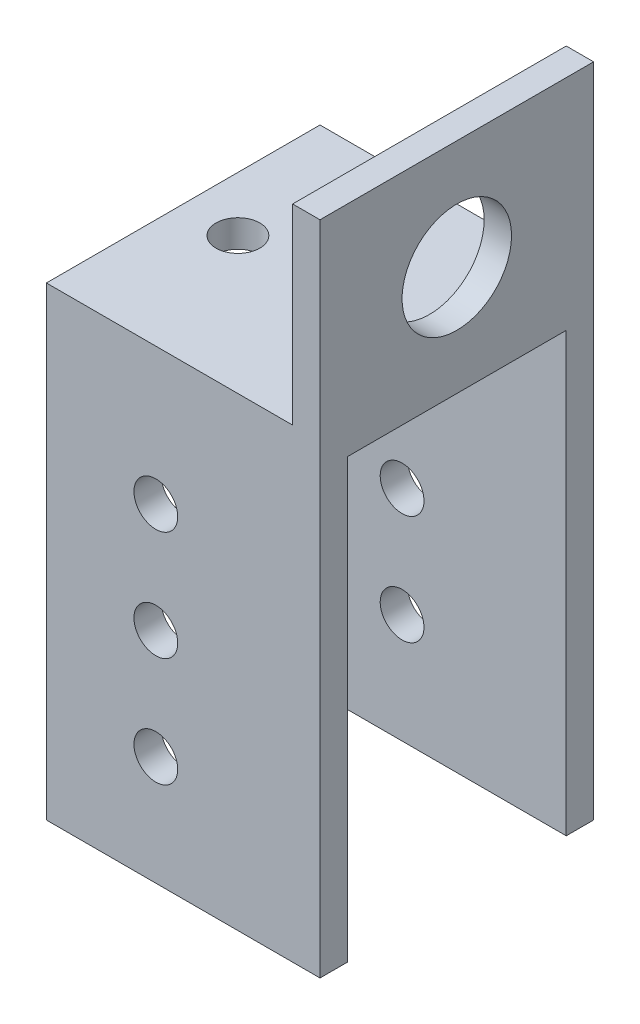
ISO-10303-21;
HEADER;
FILE_DESCRIPTION(('STEP AP214'),'2;1');
FILE_NAME('part.step','',(''),(''),'','','');
FILE_SCHEMA(('AUTOMOTIVE_DESIGN { 1 0 10303 214 1 1 1 1 }'));
ENDSEC;
DATA;
#1=APPLICATION_CONTEXT('core data for automotive mechanical design processes');
#2=APPLICATION_PROTOCOL_DEFINITION('international standard','automotive_design',2000,#1);
#3=PRODUCT_CONTEXT('',#1,'mechanical');
#4=PRODUCT('Part','Part','',(#3));
#5=PRODUCT_RELATED_PRODUCT_CATEGORY('part','',(#4));
#6=PRODUCT_DEFINITION_FORMATION('','',#4);
#7=PRODUCT_DEFINITION_CONTEXT('part definition',#1,'design');
#8=PRODUCT_DEFINITION('design','',#6,#7);
#9=PRODUCT_DEFINITION_SHAPE('','',#8);
#10=(LENGTH_UNIT() NAMED_UNIT(*) SI_UNIT(.MILLI.,.METRE.));
#11=(NAMED_UNIT(*) PLANE_ANGLE_UNIT() SI_UNIT($,.RADIAN.));
#12=(NAMED_UNIT(*) SI_UNIT($,.STERADIAN.) SOLID_ANGLE_UNIT());
#13=UNCERTAINTY_MEASURE_WITH_UNIT(LENGTH_MEASURE(1.E-05),#10,'distance_accuracy_value','');
#14=(GEOMETRIC_REPRESENTATION_CONTEXT(3) GLOBAL_UNCERTAINTY_ASSIGNED_CONTEXT((#13)) GLOBAL_UNIT_ASSIGNED_CONTEXT((#10,
#11,#12)) REPRESENTATION_CONTEXT('',''));
#15=CARTESIAN_POINT('',(0.,0.,0.));
#16=DIRECTION('',(0.,0.,1.));
#17=DIRECTION('',(1.,0.,0.));
#18=AXIS2_PLACEMENT_3D('',#15,#16,#17);
#19=CARTESIAN_POINT('',(0.,-38.1,31.75));
#20=DIRECTION('',(0.,1.,0.));
#21=DIRECTION('',(0.,0.,1.));
#22=AXIS2_PLACEMENT_3D('',#19,#20,#21);
#23=PLANE('',#22);
#24=DIRECTION('',(0.,0.,-1.));
#25=VECTOR('',#24,1.);
#26=CARTESIAN_POINT('',(15.875,-38.1,31.75));
#27=LINE('',#26,#25);
#28=CARTESIAN_POINT('',(15.875,-38.1,3.17500000000001));
#29=VERTEX_POINT('',#28);
#30=CARTESIAN_POINT('',(15.875,-38.1,0.));
#31=VERTEX_POINT('',#30);
#32=EDGE_CURVE('E180',#29,#31,#27,.T.);
#33=ORIENTED_EDGE('',*,*,#32,.F.);
#34=DIRECTION('',(-1.,0.,0.));
#35=VECTOR('',#34,1.);
#36=CARTESIAN_POINT('',(15.875,-38.1,3.17500000000001));
#37=LINE('',#36,#35);
#38=CARTESIAN_POINT('',(-15.875,-38.1,3.17500000000001));
#39=VERTEX_POINT('',#38);
#40=EDGE_CURVE('E242',#29,#39,#37,.T.);
#41=ORIENTED_EDGE('',*,*,#40,.T.);
#42=DIRECTION('',(0.,0.,-1.));
#43=VECTOR('',#42,1.);
#44=CARTESIAN_POINT('',(-15.875,-38.1,31.75));
#45=LINE('',#44,#43);
#46=CARTESIAN_POINT('',(-15.875,-38.1,0.));
#47=VERTEX_POINT('',#46);
#48=EDGE_CURVE('E131',#39,#47,#45,.T.);
#49=ORIENTED_EDGE('',*,*,#48,.T.);
#50=DIRECTION('',(1.,0.,0.));
#51=VECTOR('',#50,1.);
#52=CARTESIAN_POINT('',(0.,-38.1,0.));
#53=LINE('',#52,#51);
#54=EDGE_CURVE('E170',#47,#31,#53,.T.);
#55=ORIENTED_EDGE('',*,*,#54,.T.);
#56=EDGE_LOOP('',(#33,#41,#49,#55));
#57=FACE_BOUND('',#56,.T.);
#58=ADVANCED_FACE('F45',(#57),#23,.F.);
#59=CARTESIAN_POINT('',(0.,38.1,31.75));
#60=DIRECTION('',(0.,1.,0.));
#61=DIRECTION('',(0.,0.,1.));
#62=AXIS2_PLACEMENT_3D('',#59,#60,#61);
#63=PLANE('',#62);
#64=DIRECTION('',(1.,0.,0.));
#65=VECTOR('',#64,1.);
#66=CARTESIAN_POINT('',(0.,38.1,0.));
#67=LINE('',#66,#65);
#68=CARTESIAN_POINT('',(12.7,38.1,0.));
#69=VERTEX_POINT('',#68);
#70=CARTESIAN_POINT('',(15.875,38.1,0.));
#71=VERTEX_POINT('',#70);
#72=EDGE_CURVE('E153',#69,#71,#67,.T.);
#73=ORIENTED_EDGE('',*,*,#72,.F.);
#74=DIRECTION('',(0.,0.,-1.));
#75=VECTOR('',#74,1.);
#76=CARTESIAN_POINT('',(12.7,38.1,31.75));
#77=LINE('',#76,#75);
#78=CARTESIAN_POINT('',(12.7,38.1,31.75));
#79=VERTEX_POINT('',#78);
#80=EDGE_CURVE('E11',#79,#69,#77,.T.);
#81=ORIENTED_EDGE('',*,*,#80,.F.);
#82=DIRECTION('',(1.,0.,0.));
#83=VECTOR('',#82,1.);
#84=CARTESIAN_POINT('',(0.,38.1,31.75));
#85=LINE('',#84,#83);
#86=CARTESIAN_POINT('',(15.875,38.1,31.75));
#87=VERTEX_POINT('',#86);
#88=EDGE_CURVE('E177',#79,#87,#85,.T.);
#89=ORIENTED_EDGE('',*,*,#88,.T.);
#90=DIRECTION('',(0.,0.,-1.));
#91=VECTOR('',#90,1.);
#92=CARTESIAN_POINT('',(15.875,38.1,31.75));
#93=LINE('',#92,#91);
#94=EDGE_CURVE('E98',#87,#71,#93,.T.);
#95=ORIENTED_EDGE('',*,*,#94,.T.);
#96=EDGE_LOOP('',(#73,#81,#89,#95));
#97=FACE_BOUND('',#96,.T.);
#98=ADVANCED_FACE('F47',(#97),#63,.T.);
#99=CARTESIAN_POINT('',(12.7,0.,31.75));
#100=DIRECTION('',(1.,0.,0.));
#101=DIRECTION('',(0.,1.,0.));
#102=AXIS2_PLACEMENT_3D('',#99,#100,#101);
#103=PLANE('',#102);
#104=CARTESIAN_POINT('',(12.7,25.4,15.875));
#105=DIRECTION('',(1.,0.,0.));
#106=DIRECTION('',(0.,1.,0.));
#107=AXIS2_PLACEMENT_3D('',#104,#105,#106);
#108=CIRCLE('',#107,6.35);
#109=CARTESIAN_POINT('',(12.7,31.75,15.875));
#110=VERTEX_POINT('',#109);
#111=EDGE_CURVE('E377',#110,#110,#108,.F.);
#112=ORIENTED_EDGE('',*,*,#111,.F.);
#113=EDGE_LOOP('',(#112));
#114=FACE_BOUND('',#113,.T.);
#115=DIRECTION('',(0.,-1.,0.));
#116=VECTOR('',#115,1.);
#117=CARTESIAN_POINT('',(12.7,0.,0.));
#118=LINE('',#117,#116);
#119=CARTESIAN_POINT('',(12.7,15.875,0.));
#120=VERTEX_POINT('',#119);
#121=EDGE_CURVE('E157',#69,#120,#118,.T.);
#122=ORIENTED_EDGE('',*,*,#121,.T.);
#123=DIRECTION('',(0.,0.,-1.));
#124=VECTOR('',#123,1.);
#125=CARTESIAN_POINT('',(12.7,15.875,31.75));
#126=LINE('',#125,#124);
#127=CARTESIAN_POINT('',(12.7,15.875,31.75));
#128=VERTEX_POINT('',#127);
#129=EDGE_CURVE('E55',#128,#120,#126,.T.);
#130=ORIENTED_EDGE('',*,*,#129,.F.);
#131=DIRECTION('',(0.,-1.,0.));
#132=VECTOR('',#131,1.);
#133=CARTESIAN_POINT('',(12.7,0.,31.75));
#134=LINE('',#133,#132);
#135=EDGE_CURVE('E147',#79,#128,#134,.T.);
#136=ORIENTED_EDGE('',*,*,#135,.F.);
#137=ORIENTED_EDGE('',*,*,#80,.T.);
#138=EDGE_LOOP('',(#122,#130,#136,#137));
#139=FACE_BOUND('',#138,.T.);
#140=ADVANCED_FACE('F268',(#114,#139),#103,.F.);
#141=CARTESIAN_POINT('',(0.,15.875,31.75));
#142=DIRECTION('',(0.,1.,0.));
#143=DIRECTION('',(0.,0.,1.));
#144=AXIS2_PLACEMENT_3D('',#141,#142,#143);
#145=PLANE('',#144);
#146=CARTESIAN_POINT('',(-9.525,15.875,15.875));
#147=DIRECTION('',(0.,1.,0.));
#148=DIRECTION('',(0.,0.,1.));
#149=AXIS2_PLACEMENT_3D('',#146,#147,#148);
#150=CIRCLE('',#149,2.54);
#151=CARTESIAN_POINT('',(-9.525,15.875,18.415));
#152=VERTEX_POINT('',#151);
#153=EDGE_CURVE('E215',#152,#152,#150,.T.);
#154=ORIENTED_EDGE('',*,*,#153,.F.);
#155=EDGE_LOOP('',(#154));
#156=FACE_BOUND('',#155,.T.);
#157=CARTESIAN_POINT('',(3.175,15.875,15.875));
#158=DIRECTION('',(0.,1.,0.));
#159=DIRECTION('',(0.,0.,1.));
#160=AXIS2_PLACEMENT_3D('',#157,#158,#159);
#161=CIRCLE('',#160,2.54);
#162=CARTESIAN_POINT('',(3.175,15.875,18.415));
#163=VERTEX_POINT('',#162);
#164=EDGE_CURVE('E214',#163,#163,#161,.T.);
#165=ORIENTED_EDGE('',*,*,#164,.F.);
#166=EDGE_LOOP('',(#165));
#167=FACE_BOUND('',#166,.T.);
#168=DIRECTION('',(1.,0.,0.));
#169=VECTOR('',#168,1.);
#170=CARTESIAN_POINT('',(0.,15.875,0.));
#171=LINE('',#170,#169);
#172=CARTESIAN_POINT('',(-15.875,15.875,0.));
#173=VERTEX_POINT('',#172);
#174=EDGE_CURVE('E162',#173,#120,#171,.T.);
#175=ORIENTED_EDGE('',*,*,#174,.F.);
#176=DIRECTION('',(0.,0.,-1.));
#177=VECTOR('',#176,1.);
#178=CARTESIAN_POINT('',(-15.875,15.875,31.75));
#179=LINE('',#178,#177);
#180=CARTESIAN_POINT('',(-15.875,15.875,31.75));
#181=VERTEX_POINT('',#180);
#182=EDGE_CURVE('E130',#181,#173,#179,.T.);
#183=ORIENTED_EDGE('',*,*,#182,.F.);
#184=DIRECTION('',(1.,0.,0.));
#185=VECTOR('',#184,1.);
#186=CARTESIAN_POINT('',(0.,15.875,31.75));
#187=LINE('',#186,#185);
#188=EDGE_CURVE('E143',#181,#128,#187,.T.);
#189=ORIENTED_EDGE('',*,*,#188,.T.);
#190=ORIENTED_EDGE('',*,*,#129,.T.);
#191=EDGE_LOOP('',(#175,#183,#189,#190));
#192=FACE_BOUND('',#191,.T.);
#193=ADVANCED_FACE('F272',(#156,#167,#192),#145,.T.);
#194=CARTESIAN_POINT('',(-15.875,0.,31.75));
#195=DIRECTION('',(-1.,0.,0.));
#196=DIRECTION('',(0.,0.,1.));
#197=AXIS2_PLACEMENT_3D('',#194,#195,#196);
#198=PLANE('',#197);
#199=DIRECTION('',(0.,-1.,0.));
#200=VECTOR('',#199,1.);
#201=CARTESIAN_POINT('',(-15.875,12.7,3.175));
#202=LINE('',#201,#200);
#203=CARTESIAN_POINT('',(-15.875,12.7,3.175));
#204=VERTEX_POINT('',#203);
#205=EDGE_CURVE('E224',#204,#39,#202,.T.);
#206=ORIENTED_EDGE('',*,*,#205,.F.);
#207=DIRECTION('',(0.,0.,-1.));
#208=VECTOR('',#207,1.);
#209=CARTESIAN_POINT('',(-15.875,12.7,3.175));
#210=LINE('',#209,#208);
#211=CARTESIAN_POINT('',(-15.875,12.7,28.575));
#212=VERTEX_POINT('',#211);
#213=EDGE_CURVE('E236',#212,#204,#210,.T.);
#214=ORIENTED_EDGE('',*,*,#213,.F.);
#215=DIRECTION('',(0.,1.,0.));
#216=VECTOR('',#215,1.);
#217=CARTESIAN_POINT('',(-15.875,12.7,28.575));
#218=LINE('',#217,#216);
#219=CARTESIAN_POINT('',(-15.875,-38.1,28.575));
#220=VERTEX_POINT('',#219);
#221=EDGE_CURVE('E126',#220,#212,#218,.T.);
#222=ORIENTED_EDGE('',*,*,#221,.F.);
#223=CARTESIAN_POINT('',(-15.875,-38.1,31.75));
#224=VERTEX_POINT('',#223);
#225=EDGE_CURVE('E117',#224,#220,#45,.T.);
#226=ORIENTED_EDGE('',*,*,#225,.F.);
#227=DIRECTION('',(0.,1.,0.));
#228=VECTOR('',#227,1.);
#229=CARTESIAN_POINT('',(-15.875,0.,31.75));
#230=LINE('',#229,#228);
#231=EDGE_CURVE('E122',#224,#181,#230,.T.);
#232=ORIENTED_EDGE('',*,*,#231,.T.);
#233=ORIENTED_EDGE('',*,*,#182,.T.);
#234=DIRECTION('',(0.,1.,0.));
#235=VECTOR('',#234,1.);
#236=CARTESIAN_POINT('',(-15.875,0.,0.));
#237=LINE('',#236,#235);
#238=EDGE_CURVE('E166',#47,#173,#237,.T.);
#239=ORIENTED_EDGE('',*,*,#238,.F.);
#240=ORIENTED_EDGE('',*,*,#48,.F.);
#241=EDGE_LOOP('',(#206,#214,#222,#226,#232,#233,#239,#240));
#242=FACE_BOUND('',#241,.T.);
#243=ADVANCED_FACE('F120',(#242),#198,.T.);
#244=ORIENTED_EDGE('',*,*,#225,.T.);
#245=DIRECTION('',(-1.,0.,0.));
#246=VECTOR('',#245,1.);
#247=CARTESIAN_POINT('',(15.875,-38.1,28.575));
#248=LINE('',#247,#246);
#249=CARTESIAN_POINT('',(15.875,-38.1,28.575));
#250=VERTEX_POINT('',#249);
#251=EDGE_CURVE('E257',#250,#220,#248,.T.);
#252=ORIENTED_EDGE('',*,*,#251,.F.);
#253=CARTESIAN_POINT('',(15.875,-38.1,31.75));
#254=VERTEX_POINT('',#253);
#255=EDGE_CURVE('E137',#254,#250,#27,.T.);
#256=ORIENTED_EDGE('',*,*,#255,.F.);
#257=DIRECTION('',(1.,0.,0.));
#258=VECTOR('',#257,1.);
#259=CARTESIAN_POINT('',(0.,-38.1,31.75));
#260=LINE('',#259,#258);
#261=EDGE_CURVE('E134',#224,#254,#260,.T.);
#262=ORIENTED_EDGE('',*,*,#261,.F.);
#263=EDGE_LOOP('',(#244,#252,#256,#262));
#264=FACE_BOUND('',#263,.T.);
#265=ADVANCED_FACE('F135',(#264),#23,.F.);
#266=CARTESIAN_POINT('',(15.875,0.,31.75));
#267=DIRECTION('',(-1.,0.,0.));
#268=DIRECTION('',(0.,0.,1.));
#269=AXIS2_PLACEMENT_3D('',#266,#267,#268);
#270=PLANE('',#269);
#271=CARTESIAN_POINT('',(15.875,25.4,15.875));
#272=DIRECTION('',(1.,0.,0.));
#273=DIRECTION('',(0.,0.,-1.));
#274=AXIS2_PLACEMENT_3D('',#271,#272,#273);
#275=CIRCLE('',#274,6.35);
#276=CARTESIAN_POINT('',(15.875,25.4,9.525));
#277=VERTEX_POINT('',#276);
#278=EDGE_CURVE('E382',#277,#277,#275,.T.);
#279=ORIENTED_EDGE('',*,*,#278,.F.);
#280=EDGE_LOOP('',(#279));
#281=FACE_BOUND('',#280,.T.);
#282=DIRECTION('',(0.,0.,-1.));
#283=VECTOR('',#282,1.);
#284=CARTESIAN_POINT('',(15.875,12.7,3.175));
#285=LINE('',#284,#283);
#286=CARTESIAN_POINT('',(15.875,12.7,28.575));
#287=VERTEX_POINT('',#286);
#288=CARTESIAN_POINT('',(15.875,12.7,3.175));
#289=VERTEX_POINT('',#288);
#290=EDGE_CURVE('E63',#287,#289,#285,.T.);
#291=ORIENTED_EDGE('',*,*,#290,.T.);
#292=DIRECTION('',(0.,-1.,0.));
#293=VECTOR('',#292,1.);
#294=CARTESIAN_POINT('',(15.875,12.7,3.175));
#295=LINE('',#294,#293);
#296=EDGE_CURVE('E231',#289,#29,#295,.T.);
#297=ORIENTED_EDGE('',*,*,#296,.T.);
#298=ORIENTED_EDGE('',*,*,#32,.T.);
#299=DIRECTION('',(0.,1.,0.));
#300=VECTOR('',#299,1.);
#301=CARTESIAN_POINT('',(15.875,0.,0.));
#302=LINE('',#301,#300);
#303=EDGE_CURVE('E174',#31,#71,#302,.T.);
#304=ORIENTED_EDGE('',*,*,#303,.T.);
#305=ORIENTED_EDGE('',*,*,#94,.F.);
#306=DIRECTION('',(0.,1.,0.));
#307=VECTOR('',#306,1.);
#308=CARTESIAN_POINT('',(15.875,0.,31.75));
#309=LINE('',#308,#307);
#310=EDGE_CURVE('E72',#254,#87,#309,.T.);
#311=ORIENTED_EDGE('',*,*,#310,.F.);
#312=ORIENTED_EDGE('',*,*,#255,.T.);
#313=DIRECTION('',(0.,1.,0.));
#314=VECTOR('',#313,1.);
#315=CARTESIAN_POINT('',(15.875,12.7,28.575));
#316=LINE('',#315,#314);
#317=EDGE_CURVE('E235',#250,#287,#316,.T.);
#318=ORIENTED_EDGE('',*,*,#317,.T.);
#319=EDGE_LOOP('',(#291,#297,#298,#304,#305,#311,#312,#318));
#320=FACE_BOUND('',#319,.T.);
#321=ADVANCED_FACE('F287',(#281,#320),#270,.F.);
#322=CARTESIAN_POINT('',(0.,0.,31.75));
#323=DIRECTION('',(0.,0.,1.));
#324=DIRECTION('',(1.,0.,0.));
#325=AXIS2_PLACEMENT_3D('',#322,#323,#324);
#326=PLANE('',#325);
#327=CARTESIAN_POINT('',(-3.175,0.,31.75));
#328=DIRECTION('',(0.,0.,1.));
#329=DIRECTION('',(1.,0.,0.));
#330=AXIS2_PLACEMENT_3D('',#327,#328,#329);
#331=CIRCLE('',#330,2.54);
#332=CARTESIAN_POINT('',(-0.635000000000003,0.,31.75));
#333=VERTEX_POINT('',#332);
#334=EDGE_CURVE('E386',#333,#333,#331,.T.);
#335=ORIENTED_EDGE('',*,*,#334,.F.);
#336=EDGE_LOOP('',(#335));
#337=FACE_BOUND('',#336,.T.);
#338=CARTESIAN_POINT('',(-3.175,-12.7,31.75));
#339=DIRECTION('',(0.,0.,1.));
#340=DIRECTION('',(1.,0.,0.));
#341=AXIS2_PLACEMENT_3D('',#338,#339,#340);
#342=CIRCLE('',#341,2.54);
#343=CARTESIAN_POINT('',(-0.635000000000002,-12.7,31.75));
#344=VERTEX_POINT('',#343);
#345=EDGE_CURVE('E370',#344,#344,#342,.T.);
#346=ORIENTED_EDGE('',*,*,#345,.F.);
#347=EDGE_LOOP('',(#346));
#348=FACE_BOUND('',#347,.T.);
#349=CARTESIAN_POINT('',(-3.175,-25.4,31.75));
#350=DIRECTION('',(0.,0.,1.));
#351=DIRECTION('',(1.,0.,0.));
#352=AXIS2_PLACEMENT_3D('',#349,#350,#351);
#353=CIRCLE('',#352,2.54);
#354=CARTESIAN_POINT('',(-0.635000000000002,-25.4,31.75));
#355=VERTEX_POINT('',#354);
#356=EDGE_CURVE('E371',#355,#355,#353,.T.);
#357=ORIENTED_EDGE('',*,*,#356,.F.);
#358=EDGE_LOOP('',(#357));
#359=FACE_BOUND('',#358,.T.);
#360=ORIENTED_EDGE('',*,*,#88,.F.);
#361=ORIENTED_EDGE('',*,*,#135,.T.);
#362=ORIENTED_EDGE('',*,*,#188,.F.);
#363=ORIENTED_EDGE('',*,*,#231,.F.);
#364=ORIENTED_EDGE('',*,*,#261,.T.);
#365=ORIENTED_EDGE('',*,*,#310,.T.);
#366=EDGE_LOOP('',(#360,#361,#362,#363,#364,#365));
#367=FACE_BOUND('',#366,.T.);
#368=ADVANCED_FACE('F141',(#337,#348,#359,#367),#326,.T.);
#369=CARTESIAN_POINT('',(0.,0.,0.));
#370=DIRECTION('',(0.,0.,1.));
#371=DIRECTION('',(1.,0.,0.));
#372=AXIS2_PLACEMENT_3D('',#369,#370,#371);
#373=PLANE('',#372);
#374=CARTESIAN_POINT('',(-3.175,0.,0.));
#375=DIRECTION('',(0.,0.,1.));
#376=DIRECTION('',(1.,0.,0.));
#377=AXIS2_PLACEMENT_3D('',#374,#375,#376);
#378=CIRCLE('',#377,2.54);
#379=CARTESIAN_POINT('',(-0.635000000000003,0.,0.));
#380=VERTEX_POINT('',#379);
#381=EDGE_CURVE('E191',#380,#380,#378,.F.);
#382=ORIENTED_EDGE('',*,*,#381,.F.);
#383=EDGE_LOOP('',(#382));
#384=FACE_BOUND('',#383,.T.);
#385=CARTESIAN_POINT('',(-3.175,-12.7,0.));
#386=DIRECTION('',(0.,0.,1.));
#387=DIRECTION('',(1.,0.,0.));
#388=AXIS2_PLACEMENT_3D('',#385,#386,#387);
#389=CIRCLE('',#388,2.54);
#390=CARTESIAN_POINT('',(-0.635000000000002,-12.7,0.));
#391=VERTEX_POINT('',#390);
#392=EDGE_CURVE('E365',#391,#391,#389,.F.);
#393=ORIENTED_EDGE('',*,*,#392,.F.);
#394=EDGE_LOOP('',(#393));
#395=FACE_BOUND('',#394,.T.);
#396=CARTESIAN_POINT('',(-3.175,-25.4,0.));
#397=DIRECTION('',(0.,0.,1.));
#398=DIRECTION('',(1.,0.,0.));
#399=AXIS2_PLACEMENT_3D('',#396,#397,#398);
#400=CIRCLE('',#399,2.54);
#401=CARTESIAN_POINT('',(-0.635000000000002,-25.4,0.));
#402=VERTEX_POINT('',#401);
#403=EDGE_CURVE('E207',#402,#402,#400,.F.);
#404=ORIENTED_EDGE('',*,*,#403,.F.);
#405=EDGE_LOOP('',(#404));
#406=FACE_BOUND('',#405,.T.);
#407=ORIENTED_EDGE('',*,*,#72,.T.);
#408=ORIENTED_EDGE('',*,*,#303,.F.);
#409=ORIENTED_EDGE('',*,*,#54,.F.);
#410=ORIENTED_EDGE('',*,*,#238,.T.);
#411=ORIENTED_EDGE('',*,*,#174,.T.);
#412=ORIENTED_EDGE('',*,*,#121,.F.);
#413=EDGE_LOOP('',(#407,#408,#409,#410,#411,#412));
#414=FACE_BOUND('',#413,.T.);
#415=ADVANCED_FACE('F278',(#384,#395,#406,#414),#373,.F.);
#416=CARTESIAN_POINT('',(15.875,12.7,3.175));
#417=DIRECTION('',(0.,0.,-1.));
#418=DIRECTION('',(0.,1.,0.));
#419=AXIS2_PLACEMENT_3D('',#416,#417,#418);
#420=PLANE('',#419);
#421=CARTESIAN_POINT('',(-3.175,0.,3.175));
#422=DIRECTION('',(0.,0.,-1.));
#423=DIRECTION('',(0.,1.,0.));
#424=AXIS2_PLACEMENT_3D('',#421,#422,#423);
#425=CIRCLE('',#424,2.54);
#426=CARTESIAN_POINT('',(-3.175,2.53999999999999,3.175));
#427=VERTEX_POINT('',#426);
#428=EDGE_CURVE('E210',#427,#427,#425,.T.);
#429=ORIENTED_EDGE('',*,*,#428,.T.);
#430=EDGE_LOOP('',(#429));
#431=FACE_BOUND('',#430,.T.);
#432=CARTESIAN_POINT('',(-3.175,-12.7,3.175));
#433=DIRECTION('',(0.,0.,-1.));
#434=DIRECTION('',(0.,1.,0.));
#435=AXIS2_PLACEMENT_3D('',#432,#433,#434);
#436=CIRCLE('',#435,2.54);
#437=CARTESIAN_POINT('',(-3.175,-10.16,3.175));
#438=VERTEX_POINT('',#437);
#439=EDGE_CURVE('E195',#438,#438,#436,.T.);
#440=ORIENTED_EDGE('',*,*,#439,.T.);
#441=EDGE_LOOP('',(#440));
#442=FACE_BOUND('',#441,.T.);
#443=CARTESIAN_POINT('',(-3.175,-25.4,3.175));
#444=DIRECTION('',(0.,0.,-1.));
#445=DIRECTION('',(0.,1.,0.));
#446=AXIS2_PLACEMENT_3D('',#443,#444,#445);
#447=CIRCLE('',#446,2.54);
#448=CARTESIAN_POINT('',(-3.175,-22.86,3.175));
#449=VERTEX_POINT('',#448);
#450=EDGE_CURVE('E190',#449,#449,#447,.T.);
#451=ORIENTED_EDGE('',*,*,#450,.T.);
#452=EDGE_LOOP('',(#451));
#453=FACE_BOUND('',#452,.T.);
#454=ORIENTED_EDGE('',*,*,#205,.T.);
#455=ORIENTED_EDGE('',*,*,#40,.F.);
#456=ORIENTED_EDGE('',*,*,#296,.F.);
#457=DIRECTION('',(-1.,0.,0.));
#458=VECTOR('',#457,1.);
#459=CARTESIAN_POINT('',(15.875,12.7,3.175));
#460=LINE('',#459,#458);
#461=EDGE_CURVE('E158',#289,#204,#460,.T.);
#462=ORIENTED_EDGE('',*,*,#461,.T.);
#463=EDGE_LOOP('',(#454,#455,#456,#462));
#464=FACE_BOUND('',#463,.T.);
#465=ADVANCED_FACE('F292',(#431,#442,#453,#464),#420,.F.);
#466=CARTESIAN_POINT('',(15.875,12.7,3.175));
#467=DIRECTION('',(0.,1.,0.));
#468=DIRECTION('',(0.,0.,1.));
#469=AXIS2_PLACEMENT_3D('',#466,#467,#468);
#470=PLANE('',#469);
#471=CARTESIAN_POINT('',(-9.525,12.7,15.875));
#472=DIRECTION('',(0.,1.,0.));
#473=DIRECTION('',(0.,0.,1.));
#474=AXIS2_PLACEMENT_3D('',#471,#472,#473);
#475=CIRCLE('',#474,2.54);
#476=CARTESIAN_POINT('',(-9.525,12.7,18.415));
#477=VERTEX_POINT('',#476);
#478=EDGE_CURVE('E219',#477,#477,#475,.F.);
#479=ORIENTED_EDGE('',*,*,#478,.F.);
#480=EDGE_LOOP('',(#479));
#481=FACE_BOUND('',#480,.T.);
#482=CARTESIAN_POINT('',(3.175,12.7,15.875));
#483=DIRECTION('',(0.,1.,0.));
#484=DIRECTION('',(0.,0.,1.));
#485=AXIS2_PLACEMENT_3D('',#482,#483,#484);
#486=CIRCLE('',#485,2.54);
#487=CARTESIAN_POINT('',(3.175,12.7,18.415));
#488=VERTEX_POINT('',#487);
#489=EDGE_CURVE('E220',#488,#488,#486,.F.);
#490=ORIENTED_EDGE('',*,*,#489,.F.);
#491=EDGE_LOOP('',(#490));
#492=FACE_BOUND('',#491,.T.);
#493=ORIENTED_EDGE('',*,*,#213,.T.);
#494=ORIENTED_EDGE('',*,*,#461,.F.);
#495=ORIENTED_EDGE('',*,*,#290,.F.);
#496=DIRECTION('',(-1.,0.,0.));
#497=VECTOR('',#496,1.);
#498=CARTESIAN_POINT('',(15.875,12.7,28.575));
#499=LINE('',#498,#497);
#500=EDGE_CURVE('E254',#287,#212,#499,.T.);
#501=ORIENTED_EDGE('',*,*,#500,.T.);
#502=EDGE_LOOP('',(#493,#494,#495,#501));
#503=FACE_BOUND('',#502,.T.);
#504=ADVANCED_FACE('F299',(#481,#492,#503),#470,.F.);
#505=CARTESIAN_POINT('',(15.875,12.7,28.575));
#506=DIRECTION('',(0.,0.,1.));
#507=DIRECTION('',(0.,-1.,0.));
#508=AXIS2_PLACEMENT_3D('',#505,#506,#507);
#509=PLANE('',#508);
#510=CARTESIAN_POINT('',(-3.175,0.,28.575));
#511=DIRECTION('',(0.,0.,1.));
#512=DIRECTION('',(0.,-1.,0.));
#513=AXIS2_PLACEMENT_3D('',#510,#511,#512);
#514=CIRCLE('',#513,2.54);
#515=CARTESIAN_POINT('',(-3.175,-2.54000000000001,28.575));
#516=VERTEX_POINT('',#515);
#517=EDGE_CURVE('E49',#516,#516,#514,.T.);
#518=ORIENTED_EDGE('',*,*,#517,.T.);
#519=EDGE_LOOP('',(#518));
#520=FACE_BOUND('',#519,.T.);
#521=CARTESIAN_POINT('',(-3.175,-12.7,28.575));
#522=DIRECTION('',(0.,0.,1.));
#523=DIRECTION('',(0.,-1.,0.));
#524=AXIS2_PLACEMENT_3D('',#521,#522,#523);
#525=CIRCLE('',#524,2.54);
#526=CARTESIAN_POINT('',(-3.175,-15.24,28.575));
#527=VERTEX_POINT('',#526);
#528=EDGE_CURVE('E192',#527,#527,#525,.T.);
#529=ORIENTED_EDGE('',*,*,#528,.T.);
#530=EDGE_LOOP('',(#529));
#531=FACE_BOUND('',#530,.T.);
#532=CARTESIAN_POINT('',(-3.175,-25.4,28.575));
#533=DIRECTION('',(0.,0.,1.));
#534=DIRECTION('',(0.,-1.,0.));
#535=AXIS2_PLACEMENT_3D('',#532,#533,#534);
#536=CIRCLE('',#535,2.54);
#537=CARTESIAN_POINT('',(-3.175,-27.94,28.575));
#538=VERTEX_POINT('',#537);
#539=EDGE_CURVE('E187',#538,#538,#536,.T.);
#540=ORIENTED_EDGE('',*,*,#539,.T.);
#541=EDGE_LOOP('',(#540));
#542=FACE_BOUND('',#541,.T.);
#543=ORIENTED_EDGE('',*,*,#221,.T.);
#544=ORIENTED_EDGE('',*,*,#500,.F.);
#545=ORIENTED_EDGE('',*,*,#317,.F.);
#546=ORIENTED_EDGE('',*,*,#251,.T.);
#547=EDGE_LOOP('',(#543,#544,#545,#546));
#548=FACE_BOUND('',#547,.T.);
#549=ADVANCED_FACE('F301',(#520,#531,#542,#548),#509,.F.);
#550=CARTESIAN_POINT('',(3.175,5.51579510314467,15.875));
#551=DIRECTION('',(0.,1.,0.));
#552=DIRECTION('',(0.,0.,1.));
#553=AXIS2_PLACEMENT_3D('',#550,#551,#552);
#554=CYLINDRICAL_SURFACE('',#553,2.54);
#555=ORIENTED_EDGE('',*,*,#489,.T.);
#556=EDGE_LOOP('',(#555));
#557=FACE_BOUND('',#556,.T.);
#558=ORIENTED_EDGE('',*,*,#164,.T.);
#559=EDGE_LOOP('',(#558));
#560=FACE_BOUND('',#559,.T.);
#561=ADVANCED_FACE('F330',(#557,#560),#554,.F.);
#562=CARTESIAN_POINT('',(-9.525,5.51579510314467,15.875));
#563=DIRECTION('',(0.,1.,0.));
#564=DIRECTION('',(0.,0.,1.));
#565=AXIS2_PLACEMENT_3D('',#562,#563,#564);
#566=CYLINDRICAL_SURFACE('',#565,2.54);
#567=ORIENTED_EDGE('',*,*,#478,.T.);
#568=EDGE_LOOP('',(#567));
#569=FACE_BOUND('',#568,.T.);
#570=ORIENTED_EDGE('',*,*,#153,.T.);
#571=EDGE_LOOP('',(#570));
#572=FACE_BOUND('',#571,.T.);
#573=ADVANCED_FACE('F332',(#569,#572),#566,.F.);
#574=CARTESIAN_POINT('',(-3.175,-25.4,-7.18420489685533));
#575=DIRECTION('',(0.,0.,1.));
#576=DIRECTION('',(1.,0.,0.));
#577=AXIS2_PLACEMENT_3D('',#574,#575,#576);
#578=CYLINDRICAL_SURFACE('',#577,2.54);
#579=ORIENTED_EDGE('',*,*,#356,.T.);
#580=EDGE_LOOP('',(#579));
#581=FACE_BOUND('',#580,.T.);
#582=ORIENTED_EDGE('',*,*,#539,.F.);
#583=EDGE_LOOP('',(#582));
#584=FACE_BOUND('',#583,.T.);
#585=ADVANCED_FACE('F339',(#581,#584),#578,.F.);
#586=CARTESIAN_POINT('',(-3.175,-12.7,-7.18420489685533));
#587=DIRECTION('',(0.,0.,1.));
#588=DIRECTION('',(1.,0.,0.));
#589=AXIS2_PLACEMENT_3D('',#586,#587,#588);
#590=CYLINDRICAL_SURFACE('',#589,2.54);
#591=ORIENTED_EDGE('',*,*,#345,.T.);
#592=EDGE_LOOP('',(#591));
#593=FACE_BOUND('',#592,.T.);
#594=ORIENTED_EDGE('',*,*,#528,.F.);
#595=EDGE_LOOP('',(#594));
#596=FACE_BOUND('',#595,.T.);
#597=ADVANCED_FACE('F413',(#593,#596),#590,.F.);
#598=CARTESIAN_POINT('',(-3.175,0.,-7.18420489685533));
#599=DIRECTION('',(0.,0.,1.));
#600=DIRECTION('',(1.,0.,0.));
#601=AXIS2_PLACEMENT_3D('',#598,#599,#600);
#602=CYLINDRICAL_SURFACE('',#601,2.54);
#603=ORIENTED_EDGE('',*,*,#334,.T.);
#604=EDGE_LOOP('',(#603));
#605=FACE_BOUND('',#604,.T.);
#606=ORIENTED_EDGE('',*,*,#517,.F.);
#607=EDGE_LOOP('',(#606));
#608=FACE_BOUND('',#607,.T.);
#609=ADVANCED_FACE('F408',(#605,#608),#602,.F.);
#610=ORIENTED_EDGE('',*,*,#403,.T.);
#611=EDGE_LOOP('',(#610));
#612=FACE_BOUND('',#611,.T.);
#613=ORIENTED_EDGE('',*,*,#450,.F.);
#614=EDGE_LOOP('',(#613));
#615=FACE_BOUND('',#614,.T.);
#616=ADVANCED_FACE('F411',(#612,#615),#578,.F.);
#617=ORIENTED_EDGE('',*,*,#392,.T.);
#618=EDGE_LOOP('',(#617));
#619=FACE_BOUND('',#618,.T.);
#620=ORIENTED_EDGE('',*,*,#439,.F.);
#621=EDGE_LOOP('',(#620));
#622=FACE_BOUND('',#621,.T.);
#623=ADVANCED_FACE('F405',(#619,#622),#590,.F.);
#624=ORIENTED_EDGE('',*,*,#381,.T.);
#625=EDGE_LOOP('',(#624));
#626=FACE_BOUND('',#625,.T.);
#627=ORIENTED_EDGE('',*,*,#428,.F.);
#628=EDGE_LOOP('',(#627));
#629=FACE_BOUND('',#628,.T.);
#630=ADVANCED_FACE('F399',(#626,#629),#602,.F.);
#631=CARTESIAN_POINT('',(-5.26051224213832,25.4,15.875));
#632=DIRECTION('',(1.,0.,0.));
#633=DIRECTION('',(0.,0.,-1.));
#634=AXIS2_PLACEMENT_3D('',#631,#632,#633);
#635=CYLINDRICAL_SURFACE('',#634,6.35);
#636=ORIENTED_EDGE('',*,*,#111,.T.);
#637=EDGE_LOOP('',(#636));
#638=FACE_BOUND('',#637,.T.);
#639=ORIENTED_EDGE('',*,*,#278,.T.);
#640=EDGE_LOOP('',(#639));
#641=FACE_BOUND('',#640,.T.);
#642=ADVANCED_FACE('F397',(#638,#641),#635,.F.);
#643=CLOSED_SHELL('',(#58,#98,#140,#193,#243,#265,#321,#368,#415,#465,#504,#549,#561,#573,#585,
#597,#609,#616,#623,#630,#642));
#644=MANIFOLD_SOLID_BREP('B2',#643);
#645=ADVANCED_BREP_SHAPE_REPRESENTATION('',(#18,#644),#14);
#646=SHAPE_DEFINITION_REPRESENTATION(#9,#645);
ENDSEC;
END-ISO-10303-21;
